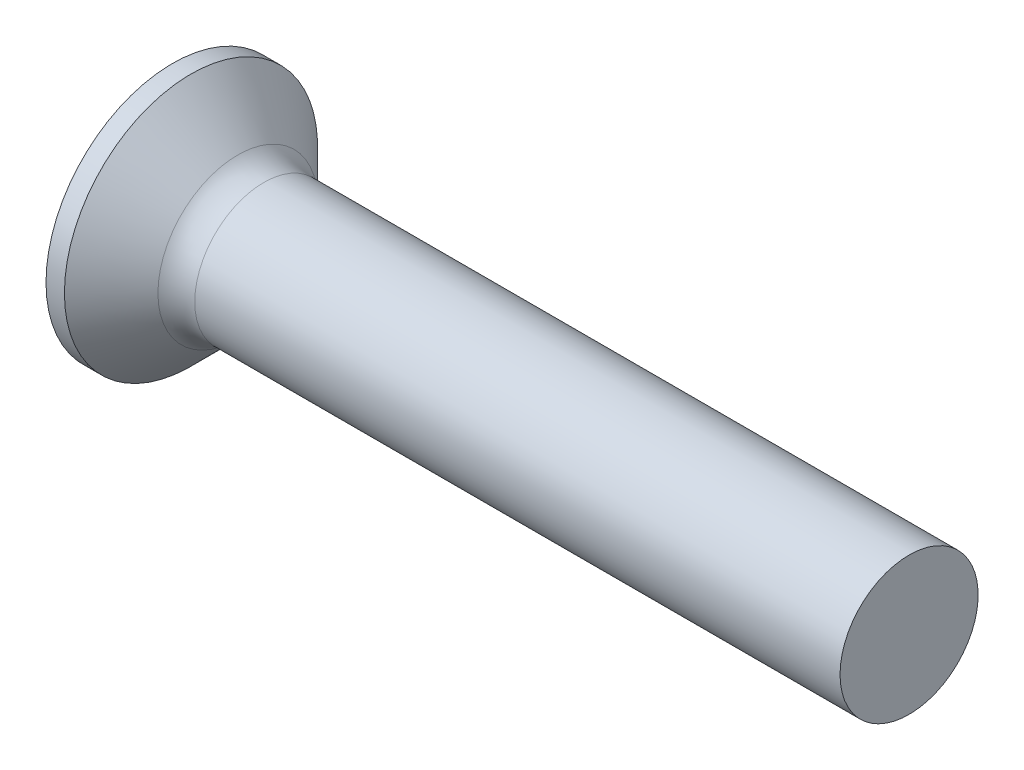
ISO-10303-21;
HEADER;
FILE_DESCRIPTION(('STEP AP214'),'2;1');
FILE_NAME('part.step','',(''),(''),'','','');
FILE_SCHEMA(('AUTOMOTIVE_DESIGN { 1 0 10303 214 1 1 1 1 }'));
ENDSEC;
DATA;
#1=APPLICATION_CONTEXT('core data for automotive mechanical design processes');
#2=APPLICATION_PROTOCOL_DEFINITION('international standard','automotive_design',2000,#1);
#3=PRODUCT_CONTEXT('',#1,'mechanical');
#4=PRODUCT('Part','Part','',(#3));
#5=PRODUCT_RELATED_PRODUCT_CATEGORY('part','',(#4));
#6=PRODUCT_DEFINITION_FORMATION('','',#4);
#7=PRODUCT_DEFINITION_CONTEXT('part definition',#1,'design');
#8=PRODUCT_DEFINITION('design','',#6,#7);
#9=PRODUCT_DEFINITION_SHAPE('','',#8);
#10=(LENGTH_UNIT() NAMED_UNIT(*) SI_UNIT(.MILLI.,.METRE.));
#11=(NAMED_UNIT(*) PLANE_ANGLE_UNIT() SI_UNIT($,.RADIAN.));
#12=(NAMED_UNIT(*) SI_UNIT($,.STERADIAN.) SOLID_ANGLE_UNIT());
#13=UNCERTAINTY_MEASURE_WITH_UNIT(LENGTH_MEASURE(1.E-05),#10,'distance_accuracy_value','');
#14=(GEOMETRIC_REPRESENTATION_CONTEXT(3) GLOBAL_UNCERTAINTY_ASSIGNED_CONTEXT((#13)) GLOBAL_UNIT_ASSIGNED_CONTEXT((#10,
#11,#12)) REPRESENTATION_CONTEXT('',''));
#15=CARTESIAN_POINT('',(0.,0.,0.));
#16=DIRECTION('',(0.,0.,1.));
#17=DIRECTION('',(1.,0.,0.));
#18=AXIS2_PLACEMENT_3D('',#15,#16,#17);
#19=CARTESIAN_POINT('',(2.01,-0.497851135403458,0.37));
#20=DIRECTION('',(0.,0.,-1.));
#21=DIRECTION('',(0.,1.,0.));
#22=AXIS2_PLACEMENT_3D('',#19,#20,#21);
#23=PLANE('',#22);
#24=DIRECTION('',(0.,-1.,0.));
#25=VECTOR('',#24,1.);
#26=CARTESIAN_POINT('',(0.,1.5,0.37));
#27=LINE('',#26,#25);
#28=CARTESIAN_POINT('',(0.,-0.590157547916263,0.37));
#29=VERTEX_POINT('',#28);
#30=CARTESIAN_POINT('',(0.,-1.5,0.37));
#31=VERTEX_POINT('',#30);
#32=EDGE_CURVE('E458',#29,#31,#27,.T.);
#33=ORIENTED_EDGE('',*,*,#32,.F.);
#34=CARTESIAN_POINT('',(-1.01053649691082,-0.672102030072118,0.37));
#35=CARTESIAN_POINT('',(-0.79970605871103,-0.655267098883947,0.37));
#36=CARTESIAN_POINT('',(-0.588886212503304,-0.638297110572311,0.37));
#37=CARTESIAN_POINT('',(-0.167272662529611,-0.603984130519828,0.37));
#38=CARTESIAN_POINT('',(0.0435210406290472,-0.586641131324258,0.37));
#39=CARTESIAN_POINT('',(0.465068838244709,-0.551479911667385,0.37));
#40=CARTESIAN_POINT('',(0.67582293271526,-0.533661691368909,0.37));
#41=CARTESIAN_POINT('',(1.09727362083221,-0.497387538872971,0.37));
#42=CARTESIAN_POINT('',(1.30797021521736,-0.478931615299089,0.37));
#43=CARTESIAN_POINT('',(1.67418894757201,-0.446067164121906,0.37));
#44=CARTESIAN_POINT('',(1.82972932585734,-0.431862501028414,0.37));
#45=CARTESIAN_POINT('',(2.14074770359484,-0.40279770973988,0.37));
#46=CARTESIAN_POINT('',(2.29622570356215,-0.38793758707517,0.37));
#47=CARTESIAN_POINT('',(2.60710169348415,-0.357305117937677,0.37));
#48=CARTESIAN_POINT('',(2.76249967840253,-0.34153271979064,0.37));
#49=CARTESIAN_POINT('',(2.99549070742189,-0.316847908281595,0.37));
#50=CARTESIAN_POINT('',(3.07313791118864,-0.308448465897182,0.37));
#51=CARTESIAN_POINT('',(3.22838341575769,-0.29120225104834,0.37));
#52=CARTESIAN_POINT('',(3.30598171599396,-0.282355473499083,0.37));
#53=CARTESIAN_POINT('',(3.38354828463398,-0.273232461289951,0.37));
#54=B_SPLINE_CURVE_WITH_KNOTS('',3,(#34,#35,#36,#37,#38,#39,#40,#41,#42,#43,#44,#45,#46,#47,#48,
#49,#50,#51,#52,#53),.UNSPECIFIED.,.F.,.F.,(4,2,2,2,2,2,2,2,2,4),(0.,0.634504777554397,
1.26902224766093,1.90353950036111,2.53804817592041,3.00661008438666,3.47516804019383,
3.94375256268972,4.17805198331268,4.41235406779909),.UNSPECIFIED.);
#55=CARTESIAN_POINT('',(2.01,-0.415013252800437,0.37));
#56=VERTEX_POINT('',#55);
#57=EDGE_CURVE('E214',#29,#56,#54,.T.);
#58=ORIENTED_EDGE('',*,*,#57,.T.);
#59=DIRECTION('',(0.,-1.,0.));
#60=VECTOR('',#59,1.);
#61=CARTESIAN_POINT('',(2.01,0.497851135403459,0.37));
#62=LINE('',#61,#60);
#63=CARTESIAN_POINT('',(2.01,-0.497851135403458,0.37));
#64=VERTEX_POINT('',#63);
#65=EDGE_CURVE('E367',#56,#64,#62,.T.);
#66=ORIENTED_EDGE('',*,*,#65,.T.);
#67=DIRECTION('',(0.894934391398442,0.446197753347436,0.));
#68=VECTOR('',#67,1.);
#69=CARTESIAN_POINT('',(0.,-1.5,0.37));
#70=LINE('',#69,#68);
#71=EDGE_CURVE('E466',#31,#64,#70,.T.);
#72=ORIENTED_EDGE('',*,*,#71,.F.);
#73=EDGE_LOOP('',(#33,#58,#66,#72));
#74=FACE_BOUND('',#73,.T.);
#75=ADVANCED_FACE('F35',(#74),#23,.T.);
#76=CARTESIAN_POINT('',(2.01,0.497851135403459,0.37));
#77=VERTEX_POINT('',#76);
#78=CARTESIAN_POINT('',(2.01,0.415013252800437,0.37));
#79=VERTEX_POINT('',#78);
#80=EDGE_CURVE('E363',#77,#79,#62,.T.);
#81=ORIENTED_EDGE('',*,*,#80,.T.);
#82=CARTESIAN_POINT('',(-1.01053649699026,0.672102030078459,0.37));
#83=CARTESIAN_POINT('',(-0.799706058781648,0.65526709888962,0.37));
#84=CARTESIAN_POINT('',(-0.588886212565099,0.638297110577309,0.37));
#85=CARTESIAN_POINT('',(-0.167272662573758,0.603984130523453,0.37));
#86=CARTESIAN_POINT('',(0.043521040593722,0.586641131327185,0.37));
#87=CARTESIAN_POINT('',(0.465068838236453,0.551479911668094,0.37));
#88=CARTESIAN_POINT('',(0.675822932725248,0.533661691368078,0.37));
#89=CARTESIAN_POINT('',(1.09727362087867,0.497387538868943,0.37));
#90=CARTESIAN_POINT('',(1.30797021528206,0.478931615293404,0.37));
#91=CARTESIAN_POINT('',(1.67418894765493,0.446067164114376,0.37));
#92=CARTESIAN_POINT('',(1.82972932594025,0.431862501020785,0.37));
#93=CARTESIAN_POINT('',(2.14074770367772,0.402797709732016,0.37));
#94=CARTESIAN_POINT('',(2.29622570364503,0.38793758706717,0.37));
#95=CARTESIAN_POINT('',(2.60710169356699,0.357305117929346,0.37));
#96=CARTESIAN_POINT('',(2.76249967848536,0.341532719782116,0.37));
#97=CARTESIAN_POINT('',(2.99549070750468,0.316847908272698,0.37));
#98=CARTESIAN_POINT('',(3.07313791127142,0.308448465888148,0.37));
#99=CARTESIAN_POINT('',(3.22838341584044,0.291202251038989,0.37));
#100=CARTESIAN_POINT('',(3.30598171607669,0.282355473489554,0.37));
#101=CARTESIAN_POINT('',(3.38354828471668,0.273232461280216,0.37));
#102=B_SPLINE_CURVE_WITH_KNOTS('',3,(#82,#83,#84,#85,#86,#87,#88,#89,#90,#91,#92,#93,#94,#95,
#96,#97,#98,#99,#100,#101),.UNSPECIFIED.,.F.,.F.,(4,2,2,2,2,2,2,2,2,4),(0.,0.634504777580945,
1.26902224771403,1.90353950046914,2.53804817608336,3.00661008454961,3.47516804035678,
3.94375256285268,4.17805198347564,4.41235406796206),.UNSPECIFIED.);
#103=CARTESIAN_POINT('',(0.,0.590157547916263,0.37));
#104=VERTEX_POINT('',#103);
#105=EDGE_CURVE('E207',#79,#104,#102,.F.);
#106=ORIENTED_EDGE('',*,*,#105,.T.);
#107=CARTESIAN_POINT('',(0.,1.5,0.37));
#108=VERTEX_POINT('',#107);
#109=EDGE_CURVE('E460',#108,#104,#27,.T.);
#110=ORIENTED_EDGE('',*,*,#109,.F.);
#111=DIRECTION('',(0.894934391398442,-0.446197753347436,0.));
#112=VECTOR('',#111,1.);
#113=CARTESIAN_POINT('',(0.,1.5,0.37));
#114=LINE('',#113,#112);
#115=EDGE_CURVE('E58',#108,#77,#114,.T.);
#116=ORIENTED_EDGE('',*,*,#115,.T.);
#117=EDGE_LOOP('',(#81,#106,#110,#116));
#118=FACE_BOUND('',#117,.T.);
#119=ADVANCED_FACE('F189',(#118),#23,.T.);
#120=CARTESIAN_POINT('',(2.01,0.497851135403458,-0.37));
#121=DIRECTION('',(0.,0.,1.));
#122=DIRECTION('',(1.,0.,0.));
#123=AXIS2_PLACEMENT_3D('',#120,#121,#122);
#124=PLANE('',#123);
#125=DIRECTION('',(0.,1.,0.));
#126=VECTOR('',#125,1.);
#127=CARTESIAN_POINT('',(2.01,-0.497851135403458,-0.37));
#128=LINE('',#127,#126);
#129=CARTESIAN_POINT('',(2.01,-0.497851135403458,-0.37));
#130=VERTEX_POINT('',#129);
#131=CARTESIAN_POINT('',(2.01,-0.415013252800437,-0.37));
#132=VERTEX_POINT('',#131);
#133=EDGE_CURVE('E376',#130,#132,#128,.T.);
#134=ORIENTED_EDGE('',*,*,#133,.T.);
#135=CARTESIAN_POINT('',(-1.01053649691082,-0.672102030072118,-0.37));
#136=CARTESIAN_POINT('',(-0.79970605871103,-0.655267098883947,-0.37));
#137=CARTESIAN_POINT('',(-0.588886212503305,-0.638297110572311,-0.37));
#138=CARTESIAN_POINT('',(-0.16727266252961,-0.603984130519828,-0.37));
#139=CARTESIAN_POINT('',(0.0435210406290472,-0.586641131324259,-0.37));
#140=CARTESIAN_POINT('',(0.465068838244709,-0.551479911667385,-0.37));
#141=CARTESIAN_POINT('',(0.67582293271526,-0.533661691368909,-0.37));
#142=CARTESIAN_POINT('',(1.09727362083221,-0.497387538872971,-0.37));
#143=CARTESIAN_POINT('',(1.30797021521736,-0.47893161529909,-0.37));
#144=CARTESIAN_POINT('',(1.67418894757201,-0.446067164121906,-0.37));
#145=CARTESIAN_POINT('',(1.82972932585734,-0.431862501028414,-0.37));
#146=CARTESIAN_POINT('',(2.14074770359484,-0.40279770973988,-0.37));
#147=CARTESIAN_POINT('',(2.29622570356215,-0.38793758707517,-0.37));
#148=CARTESIAN_POINT('',(2.60710169348415,-0.357305117937677,-0.37));
#149=CARTESIAN_POINT('',(2.76249967840254,-0.34153271979064,-0.37));
#150=CARTESIAN_POINT('',(2.99549070742189,-0.316847908281595,-0.37));
#151=CARTESIAN_POINT('',(3.07313791118864,-0.308448465897182,-0.37));
#152=CARTESIAN_POINT('',(3.22838341575769,-0.29120225104834,-0.37));
#153=CARTESIAN_POINT('',(3.30598171599396,-0.282355473499083,-0.37));
#154=CARTESIAN_POINT('',(3.38354828463398,-0.273232461289951,-0.37));
#155=B_SPLINE_CURVE_WITH_KNOTS('',3,(#135,#136,#137,#138,#139,#140,#141,#142,#143,#144,#145,
#146,#147,#148,#149,#150,#151,#152,#153,#154),.UNSPECIFIED.,.F.,.F.,(4,2,2,2,2,2,2,2,2,4),(0.,
0.634504777554397,1.26902224766093,1.90353950036111,2.53804817592041,3.00661008438666,
3.47516804019383,3.94375256268973,4.17805198331268,4.41235406779909),.UNSPECIFIED.);
#156=CARTESIAN_POINT('',(0.,-0.590157547916263,-0.37));
#157=VERTEX_POINT('',#156);
#158=EDGE_CURVE('E270',#132,#157,#155,.F.);
#159=ORIENTED_EDGE('',*,*,#158,.T.);
#160=DIRECTION('',(0.,1.,0.));
#161=VECTOR('',#160,1.);
#162=CARTESIAN_POINT('',(0.,-1.5,-0.37));
#163=LINE('',#162,#161);
#164=CARTESIAN_POINT('',(0.,-1.5,-0.37));
#165=VERTEX_POINT('',#164);
#166=EDGE_CURVE('E459',#165,#157,#163,.T.);
#167=ORIENTED_EDGE('',*,*,#166,.F.);
#168=DIRECTION('',(0.894934391398442,0.446197753347436,0.));
#169=VECTOR('',#168,1.);
#170=CARTESIAN_POINT('',(0.,-1.5,-0.37));
#171=LINE('',#170,#169);
#172=EDGE_CURVE('E469',#165,#130,#171,.T.);
#173=ORIENTED_EDGE('',*,*,#172,.T.);
#174=EDGE_LOOP('',(#134,#159,#167,#173));
#175=FACE_BOUND('',#174,.T.);
#176=ADVANCED_FACE('F195',(#175),#124,.T.);
#177=CARTESIAN_POINT('',(0.,0.590157547916263,-0.37));
#178=VERTEX_POINT('',#177);
#179=CARTESIAN_POINT('',(0.,1.5,-0.37));
#180=VERTEX_POINT('',#179);
#181=EDGE_CURVE('E465',#178,#180,#163,.T.);
#182=ORIENTED_EDGE('',*,*,#181,.F.);
#183=CARTESIAN_POINT('',(-1.01053649691082,0.672102030072118,-0.37));
#184=CARTESIAN_POINT('',(-0.79970605871103,0.655267098883947,-0.37));
#185=CARTESIAN_POINT('',(-0.588886212503304,0.638297110572311,-0.37));
#186=CARTESIAN_POINT('',(-0.16727266252961,0.603984130519828,-0.37));
#187=CARTESIAN_POINT('',(0.0435210406290473,0.586641131324259,-0.37));
#188=CARTESIAN_POINT('',(0.465068838244709,0.551479911667385,-0.37));
#189=CARTESIAN_POINT('',(0.67582293271526,0.533661691368909,-0.37));
#190=CARTESIAN_POINT('',(1.09727362083221,0.497387538872971,-0.37));
#191=CARTESIAN_POINT('',(1.30797021521736,0.478931615299089,-0.37));
#192=CARTESIAN_POINT('',(1.67418894757201,0.446067164121906,-0.37));
#193=CARTESIAN_POINT('',(1.82972932585734,0.431862501028415,-0.37));
#194=CARTESIAN_POINT('',(2.14074770359484,0.40279770973988,-0.37));
#195=CARTESIAN_POINT('',(2.29622570356215,0.38793758707517,-0.37));
#196=CARTESIAN_POINT('',(2.60710169348415,0.357305117937677,-0.37));
#197=CARTESIAN_POINT('',(2.76249967840253,0.34153271979064,-0.37));
#198=CARTESIAN_POINT('',(2.99549070742189,0.316847908281595,-0.37));
#199=CARTESIAN_POINT('',(3.07313791118864,0.308448465897183,-0.37));
#200=CARTESIAN_POINT('',(3.22838341575769,0.29120225104834,-0.37));
#201=CARTESIAN_POINT('',(3.30598171599396,0.282355473499083,-0.37));
#202=CARTESIAN_POINT('',(3.38354828463398,0.273232461289951,-0.37));
#203=B_SPLINE_CURVE_WITH_KNOTS('',3,(#183,#184,#185,#186,#187,#188,#189,#190,#191,#192,#193,
#194,#195,#196,#197,#198,#199,#200,#201,#202),.UNSPECIFIED.,.F.,.F.,(4,2,2,2,2,2,2,2,2,4),(0.,
0.634504777554397,1.26902224766093,1.90353950036111,2.53804817592041,3.00661008438666,
3.47516804019383,3.94375256268972,4.17805198331267,4.41235406779909),.UNSPECIFIED.);
#204=CARTESIAN_POINT('',(2.01,0.415013252800437,-0.37));
#205=VERTEX_POINT('',#204);
#206=EDGE_CURVE('E264',#178,#205,#203,.T.);
#207=ORIENTED_EDGE('',*,*,#206,.T.);
#208=CARTESIAN_POINT('',(2.01,0.497851135403459,-0.37));
#209=VERTEX_POINT('',#208);
#210=EDGE_CURVE('E378',#205,#209,#128,.T.);
#211=ORIENTED_EDGE('',*,*,#210,.T.);
#212=DIRECTION('',(0.894934391398442,-0.446197753347436,0.));
#213=VECTOR('',#212,1.);
#214=CARTESIAN_POINT('',(0.,1.5,-0.37));
#215=LINE('',#214,#213);
#216=EDGE_CURVE('E375',#180,#209,#215,.T.);
#217=ORIENTED_EDGE('',*,*,#216,.F.);
#218=EDGE_LOOP('',(#182,#207,#211,#217));
#219=FACE_BOUND('',#218,.T.);
#220=ADVANCED_FACE('F476',(#219),#124,.T.);
#221=CARTESIAN_POINT('',(2.01,0.497851135403459,-0.37));
#222=DIRECTION('',(1.,0.,0.));
#223=DIRECTION('',(0.,0.,-1.));
#224=AXIS2_PLACEMENT_3D('',#221,#222,#223);
#225=PLANE('',#224);
#226=CARTESIAN_POINT('',(2.01,0.,0.));
#227=DIRECTION('',(-1.,0.,0.));
#228=DIRECTION('',(0.,0.,1.));
#229=AXIS2_PLACEMENT_3D('',#226,#227,#228);
#230=CIRCLE('',#229,0.555999999999999);
#231=CARTESIAN_POINT('',(2.01,-0.24754847399547,-0.497851135403459));
#232=VERTEX_POINT('',#231);
#233=CARTESIAN_POINT('',(2.01,-0.369999999999999,-0.415013252800438));
#234=VERTEX_POINT('',#233);
#235=EDGE_CURVE('E342',#232,#234,#230,.T.);
#236=ORIENTED_EDGE('',*,*,#235,.F.);
#237=DIRECTION('',(0.,1.,0.));
#238=VECTOR('',#237,1.);
#239=CARTESIAN_POINT('',(2.01,-0.369999999999998,-0.49785113540346));
#240=LINE('',#239,#238);
#241=CARTESIAN_POINT('',(2.01,-0.369999999999998,-0.49785113540346));
#242=VERTEX_POINT('',#241);
#243=EDGE_CURVE('E443',#242,#232,#240,.T.);
#244=ORIENTED_EDGE('',*,*,#243,.F.);
#245=DIRECTION('',(0.,0.,-1.));
#246=VECTOR('',#245,1.);
#247=CARTESIAN_POINT('',(2.01,-0.370000000000002,0.497851135403457));
#248=LINE('',#247,#246);
#249=EDGE_CURVE('E447',#234,#242,#248,.T.);
#250=ORIENTED_EDGE('',*,*,#249,.F.);
#251=EDGE_LOOP('',(#236,#244,#250));
#252=FACE_BOUND('',#251,.T.);
#253=ADVANCED_FACE('F489',(#252),#225,.F.);
#254=CARTESIAN_POINT('',(2.01,-0.497851135403458,-0.247548473995472));
#255=VERTEX_POINT('',#254);
#256=EDGE_CURVE('E337',#132,#255,#230,.T.);
#257=ORIENTED_EDGE('',*,*,#256,.F.);
#258=ORIENTED_EDGE('',*,*,#133,.F.);
#259=DIRECTION('',(0.,0.,-1.));
#260=VECTOR('',#259,1.);
#261=CARTESIAN_POINT('',(2.01,-0.497851135403458,0.37));
#262=LINE('',#261,#260);
#263=EDGE_CURVE('E366',#255,#130,#262,.T.);
#264=ORIENTED_EDGE('',*,*,#263,.F.);
#265=EDGE_LOOP('',(#257,#258,#264));
#266=FACE_BOUND('',#265,.T.);
#267=ADVANCED_FACE('F495',(#266),#225,.F.);
#268=CARTESIAN_POINT('',(2.01,-0.497851135403458,0.247548473995472));
#269=VERTEX_POINT('',#268);
#270=EDGE_CURVE('E332',#269,#56,#230,.T.);
#271=ORIENTED_EDGE('',*,*,#270,.F.);
#272=EDGE_CURVE('E369',#64,#269,#262,.T.);
#273=ORIENTED_EDGE('',*,*,#272,.F.);
#274=ORIENTED_EDGE('',*,*,#65,.F.);
#275=EDGE_LOOP('',(#271,#273,#274));
#276=FACE_BOUND('',#275,.T.);
#277=ADVANCED_FACE('F501',(#276),#225,.F.);
#278=CARTESIAN_POINT('',(2.01,-0.370000000000001,0.415013252800436));
#279=VERTEX_POINT('',#278);
#280=CARTESIAN_POINT('',(2.01,-0.247548473995473,0.497851135403458));
#281=VERTEX_POINT('',#280);
#282=EDGE_CURVE('E50',#279,#281,#230,.T.);
#283=ORIENTED_EDGE('',*,*,#282,.F.);
#284=CARTESIAN_POINT('',(2.01,-0.370000000000002,0.497851135403457));
#285=VERTEX_POINT('',#284);
#286=EDGE_CURVE('E449',#285,#279,#248,.T.);
#287=ORIENTED_EDGE('',*,*,#286,.F.);
#288=DIRECTION('',(0.,-1.,0.));
#289=VECTOR('',#288,1.);
#290=CARTESIAN_POINT('',(2.01,0.369999999999998,0.49785113540346));
#291=LINE('',#290,#289);
#292=EDGE_CURVE('E448',#281,#285,#291,.T.);
#293=ORIENTED_EDGE('',*,*,#292,.F.);
#294=EDGE_LOOP('',(#283,#287,#293));
#295=FACE_BOUND('',#294,.T.);
#296=ADVANCED_FACE('F528',(#295),#225,.F.);
#297=CARTESIAN_POINT('',(2.01,0.24754847399547,0.497851135403459));
#298=VERTEX_POINT('',#297);
#299=CARTESIAN_POINT('',(2.01,0.369999999999999,0.415013252800438));
#300=VERTEX_POINT('',#299);
#301=EDGE_CURVE('E323',#298,#300,#230,.T.);
#302=ORIENTED_EDGE('',*,*,#301,.F.);
#303=CARTESIAN_POINT('',(2.01,0.369999999999998,0.49785113540346));
#304=VERTEX_POINT('',#303);
#305=EDGE_CURVE('E444',#304,#298,#291,.T.);
#306=ORIENTED_EDGE('',*,*,#305,.F.);
#307=DIRECTION('',(0.,0.,1.));
#308=VECTOR('',#307,1.);
#309=CARTESIAN_POINT('',(2.01,0.370000000000002,-0.497851135403457));
#310=LINE('',#309,#308);
#311=EDGE_CURVE('E221',#300,#304,#310,.T.);
#312=ORIENTED_EDGE('',*,*,#311,.F.);
#313=EDGE_LOOP('',(#302,#306,#312));
#314=FACE_BOUND('',#313,.T.);
#315=ADVANCED_FACE('F485',(#314),#225,.F.);
#316=CARTESIAN_POINT('',(2.01,0.497851135403459,0.247548473995472));
#317=VERTEX_POINT('',#316);
#318=EDGE_CURVE('E330',#79,#317,#230,.T.);
#319=ORIENTED_EDGE('',*,*,#318,.F.);
#320=ORIENTED_EDGE('',*,*,#80,.F.);
#321=DIRECTION('',(0.,0.,1.));
#322=VECTOR('',#321,1.);
#323=CARTESIAN_POINT('',(2.01,0.497851135403459,-0.37));
#324=LINE('',#323,#322);
#325=EDGE_CURVE('E364',#317,#77,#324,.T.);
#326=ORIENTED_EDGE('',*,*,#325,.F.);
#327=EDGE_LOOP('',(#319,#320,#326));
#328=FACE_BOUND('',#327,.T.);
#329=ADVANCED_FACE('F362',(#328),#225,.F.);
#330=CARTESIAN_POINT('',(2.01,0.497851135403459,-0.247548473995472));
#331=VERTEX_POINT('',#330);
#332=EDGE_CURVE('E352',#331,#205,#230,.T.);
#333=ORIENTED_EDGE('',*,*,#332,.F.);
#334=EDGE_CURVE('E371',#209,#331,#324,.T.);
#335=ORIENTED_EDGE('',*,*,#334,.F.);
#336=ORIENTED_EDGE('',*,*,#210,.F.);
#337=EDGE_LOOP('',(#333,#335,#336));
#338=FACE_BOUND('',#337,.T.);
#339=ADVANCED_FACE('F478',(#338),#225,.F.);
#340=CARTESIAN_POINT('',(2.01,-0.497851135403458,-0.37));
#341=DIRECTION('',(-0.446197753347436,0.894934391398443,0.));
#342=DIRECTION('',(-0.894934391398442,-0.446197753347436,0.));
#343=AXIS2_PLACEMENT_3D('',#340,#341,#342);
#344=PLANE('',#343);
#345=ORIENTED_EDGE('',*,*,#272,.T.);
#346=CARTESIAN_POINT('',(2.86902919914418,-0.0695550475538963,0.));
#347=DIRECTION('',(-0.446197753347436,0.894934391398443,0.));
#348=DIRECTION('',(-0.894934391398443,-0.446197753347436,0.));
#349=AXIS2_PLACEMENT_3D('',#346,#347,#348);
#350=ELLIPSE('',#349,1.11145971268776,0.491029001453358);
#351=EDGE_CURVE('E282',#269,#255,#350,.F.);
#352=ORIENTED_EDGE('',*,*,#351,.T.);
#353=ORIENTED_EDGE('',*,*,#263,.T.);
#354=ORIENTED_EDGE('',*,*,#172,.F.);
#355=DIRECTION('',(0.,0.,-1.));
#356=VECTOR('',#355,1.);
#357=CARTESIAN_POINT('',(0.,-1.5,0.37));
#358=LINE('',#357,#356);
#359=EDGE_CURVE('E383',#31,#165,#358,.T.);
#360=ORIENTED_EDGE('',*,*,#359,.F.);
#361=ORIENTED_EDGE('',*,*,#71,.T.);
#362=EDGE_LOOP('',(#345,#352,#353,#354,#360,#361));
#363=FACE_BOUND('',#362,.T.);
#364=ADVANCED_FACE('F201',(#363),#344,.T.);
#365=CARTESIAN_POINT('',(2.01,0.497851135403459,0.37));
#366=DIRECTION('',(-0.446197753347436,-0.894934391398443,0.));
#367=DIRECTION('',(0.894934391398442,-0.446197753347436,0.));
#368=AXIS2_PLACEMENT_3D('',#365,#366,#367);
#369=PLANE('',#368);
#370=ORIENTED_EDGE('',*,*,#334,.T.);
#371=CARTESIAN_POINT('',(2.86902919914418,0.0695550475538964,0.));
#372=DIRECTION('',(-0.446197753347436,-0.894934391398443,0.));
#373=DIRECTION('',(-0.894934391398443,0.446197753347436,0.));
#374=AXIS2_PLACEMENT_3D('',#371,#372,#373);
#375=ELLIPSE('',#374,1.11145971268776,0.491029001453358);
#376=EDGE_CURVE('E287',#331,#317,#375,.F.);
#377=ORIENTED_EDGE('',*,*,#376,.T.);
#378=ORIENTED_EDGE('',*,*,#325,.T.);
#379=ORIENTED_EDGE('',*,*,#115,.F.);
#380=DIRECTION('',(0.,0.,1.));
#381=VECTOR('',#380,1.);
#382=CARTESIAN_POINT('',(0.,1.5,-0.37));
#383=LINE('',#382,#381);
#384=EDGE_CURVE('E455',#180,#108,#383,.T.);
#385=ORIENTED_EDGE('',*,*,#384,.F.);
#386=ORIENTED_EDGE('',*,*,#216,.T.);
#387=EDGE_LOOP('',(#370,#377,#378,#379,#385,#386));
#388=FACE_BOUND('',#387,.T.);
#389=ADVANCED_FACE('F474',(#388),#369,.T.);
#390=CARTESIAN_POINT('',(2.01,0.369999999999998,0.497851135403459));
#391=DIRECTION('',(0.,-1.,0.));
#392=DIRECTION('',(1.,0.,0.));
#393=AXIS2_PLACEMENT_3D('',#390,#391,#392);
#394=PLANE('',#393);
#395=CARTESIAN_POINT('',(2.01,0.370000000000002,-0.497851135403457));
#396=VERTEX_POINT('',#395);
#397=CARTESIAN_POINT('',(2.01,0.370000000000001,-0.415013252800436));
#398=VERTEX_POINT('',#397);
#399=EDGE_CURVE('E453',#396,#398,#310,.T.);
#400=ORIENTED_EDGE('',*,*,#399,.T.);
#401=CARTESIAN_POINT('',(-1.01053649699026,0.370000000000002,-0.672102030078458));
#402=CARTESIAN_POINT('',(-0.799706058781648,0.370000000000002,-0.655267098889619));
#403=CARTESIAN_POINT('',(-0.588886212565099,0.370000000000002,-0.638297110577308));
#404=CARTESIAN_POINT('',(-0.167272662573758,0.370000000000002,-0.603984130523452));
#405=CARTESIAN_POINT('',(0.0435210405937218,0.370000000000002,-0.586641131327184));
#406=CARTESIAN_POINT('',(0.465068838236452,0.370000000000002,-0.551479911668093));
#407=CARTESIAN_POINT('',(0.675822932725247,0.370000000000002,-0.533661691368077));
#408=CARTESIAN_POINT('',(1.09727362087867,0.370000000000002,-0.497387538868942));
#409=CARTESIAN_POINT('',(1.30797021528206,0.370000000000002,-0.478931615293403));
#410=CARTESIAN_POINT('',(1.67418894765493,0.370000000000001,-0.446067164114375));
#411=CARTESIAN_POINT('',(1.82972932594025,0.370000000000001,-0.431862501020784));
#412=CARTESIAN_POINT('',(2.14074770367772,0.370000000000001,-0.402797709732014));
#413=CARTESIAN_POINT('',(2.29622570364503,0.370000000000001,-0.387937587067169));
#414=CARTESIAN_POINT('',(2.60710169356699,0.370000000000001,-0.357305117929345));
#415=CARTESIAN_POINT('',(2.76249967848536,0.370000000000001,-0.341532719782114));
#416=CARTESIAN_POINT('',(2.99549070750468,0.370000000000001,-0.316847908272697));
#417=CARTESIAN_POINT('',(3.07313791127142,0.370000000000001,-0.308448465888147));
#418=CARTESIAN_POINT('',(3.22838341584044,0.370000000000001,-0.291202251038988));
#419=CARTESIAN_POINT('',(3.30598171607669,0.370000000000001,-0.282355473489552));
#420=CARTESIAN_POINT('',(3.38354828471668,0.370000000000001,-0.273232461280215));
#421=B_SPLINE_CURVE_WITH_KNOTS('',3,(#401,#402,#403,#404,#405,#406,#407,#408,#409,#410,#411,
#412,#413,#414,#415,#416,#417,#418,#419,#420),.UNSPECIFIED.,.F.,.F.,(4,2,2,2,2,2,2,2,2,4),(0.,
0.634504777580945,1.26902224771403,1.90353950046914,2.53804817608336,3.00661008454961,
3.47516804035678,3.94375256285268,4.17805198347564,4.41235406796206),.UNSPECIFIED.);
#422=CARTESIAN_POINT('',(0.,0.370000000000002,-0.590157547916262));
#423=VERTEX_POINT('',#422);
#424=EDGE_CURVE('E256',#398,#423,#421,.F.);
#425=ORIENTED_EDGE('',*,*,#424,.T.);
#426=DIRECTION('',(0.,0.,1.));
#427=VECTOR('',#426,1.);
#428=CARTESIAN_POINT('',(0.,0.370000000000005,-1.5));
#429=LINE('',#428,#427);
#430=CARTESIAN_POINT('',(0.,0.370000000000005,-1.5));
#431=VERTEX_POINT('',#430);
#432=EDGE_CURVE('E429',#431,#423,#429,.T.);
#433=ORIENTED_EDGE('',*,*,#432,.F.);
#434=DIRECTION('',(0.894934391398442,0.,0.446197753347436));
#435=VECTOR('',#434,1.);
#436=CARTESIAN_POINT('',(0.,0.370000000000005,-1.5));
#437=LINE('',#436,#435);
#438=EDGE_CURVE('E435',#431,#396,#437,.T.);
#439=ORIENTED_EDGE('',*,*,#438,.T.);
#440=EDGE_LOOP('',(#400,#425,#433,#439));
#441=FACE_BOUND('',#440,.T.);
#442=ADVANCED_FACE('F608',(#441),#394,.T.);
#443=CARTESIAN_POINT('',(2.01,-0.369999999999998,-0.497851135403459));
#444=DIRECTION('',(0.,1.,0.));
#445=DIRECTION('',(0.,0.,1.));
#446=AXIS2_PLACEMENT_3D('',#443,#444,#445);
#447=PLANE('',#446);
#448=DIRECTION('',(0.,0.,-1.));
#449=VECTOR('',#448,1.);
#450=CARTESIAN_POINT('',(0.,-0.370000000000005,1.5));
#451=LINE('',#450,#449);
#452=CARTESIAN_POINT('',(0.,-0.369999999999998,-0.590157547916264));
#453=VERTEX_POINT('',#452);
#454=CARTESIAN_POINT('',(0.,-0.369999999999995,-1.5));
#455=VERTEX_POINT('',#454);
#456=EDGE_CURVE('E425',#453,#455,#451,.T.);
#457=ORIENTED_EDGE('',*,*,#456,.F.);
#458=CARTESIAN_POINT('',(-1.01053649699026,-0.369999999999998,-0.67210203007846));
#459=CARTESIAN_POINT('',(-0.799706058781648,-0.369999999999998,-0.655267098889622));
#460=CARTESIAN_POINT('',(-0.588886212565099,-0.369999999999998,-0.638297110577311));
#461=CARTESIAN_POINT('',(-0.167272662573759,-0.369999999999998,-0.603984130523454));
#462=CARTESIAN_POINT('',(0.0435210405937218,-0.369999999999998,-0.586641131327186));
#463=CARTESIAN_POINT('',(0.465068838236453,-0.369999999999998,-0.551479911668095));
#464=CARTESIAN_POINT('',(0.675822932725248,-0.369999999999998,-0.53366169136808));
#465=CARTESIAN_POINT('',(1.09727362087867,-0.369999999999998,-0.497387538868944));
#466=CARTESIAN_POINT('',(1.30797021528206,-0.369999999999998,-0.478931615293405));
#467=CARTESIAN_POINT('',(1.67418894765493,-0.369999999999999,-0.446067164114377));
#468=CARTESIAN_POINT('',(1.82972932594025,-0.369999999999999,-0.431862501020786));
#469=CARTESIAN_POINT('',(2.14074770367772,-0.369999999999999,-0.402797709732017));
#470=CARTESIAN_POINT('',(2.29622570364503,-0.369999999999999,-0.387937587067171));
#471=CARTESIAN_POINT('',(2.60710169356699,-0.369999999999999,-0.357305117929348));
#472=CARTESIAN_POINT('',(2.76249967848536,-0.369999999999999,-0.341532719782117));
#473=CARTESIAN_POINT('',(2.99549070750468,-0.369999999999999,-0.316847908272699));
#474=CARTESIAN_POINT('',(3.07313791127142,-0.369999999999999,-0.30844846588815));
#475=CARTESIAN_POINT('',(3.22838341584044,-0.369999999999999,-0.291202251038991));
#476=CARTESIAN_POINT('',(3.30598171607669,-0.369999999999999,-0.282355473489555));
#477=CARTESIAN_POINT('',(3.38354828471668,-0.369999999999999,-0.273232461280217));
#478=B_SPLINE_CURVE_WITH_KNOTS('',3,(#458,#459,#460,#461,#462,#463,#464,#465,#466,#467,#468,
#469,#470,#471,#472,#473,#474,#475,#476,#477),.UNSPECIFIED.,.F.,.F.,(4,2,2,2,2,2,2,2,2,4),(0.,
0.634504777580943,1.26902224771403,1.90353950046914,2.53804817608336,3.00661008454961,
3.47516804035678,3.94375256285268,4.17805198347564,4.41235406796206),.UNSPECIFIED.);
#479=EDGE_CURVE('E249',#453,#234,#478,.T.);
#480=ORIENTED_EDGE('',*,*,#479,.T.);
#481=ORIENTED_EDGE('',*,*,#249,.T.);
#482=DIRECTION('',(0.894934391398442,0.,0.446197753347436));
#483=VECTOR('',#482,1.);
#484=CARTESIAN_POINT('',(0.,-0.369999999999995,-1.5));
#485=LINE('',#484,#483);
#486=EDGE_CURVE('E432',#455,#242,#485,.T.);
#487=ORIENTED_EDGE('',*,*,#486,.F.);
#488=EDGE_LOOP('',(#457,#480,#481,#487));
#489=FACE_BOUND('',#488,.T.);
#490=ADVANCED_FACE('F506',(#489),#447,.T.);
#491=CARTESIAN_POINT('',(2.01,0.370000000000002,-0.497851135403457));
#492=DIRECTION('',(-0.446197753347436,0.,0.894934391398443));
#493=DIRECTION('',(-0.894934391398442,0.,-0.446197753347436));
#494=AXIS2_PLACEMENT_3D('',#491,#492,#493);
#495=PLANE('',#494);
#496=ORIENTED_EDGE('',*,*,#243,.T.);
#497=CARTESIAN_POINT('',(2.86902919914418,0.,-0.0695550475538964));
#498=DIRECTION('',(-0.446197753347436,0.,0.894934391398443));
#499=DIRECTION('',(-0.894934391398443,0.,-0.446197753347436));
#500=AXIS2_PLACEMENT_3D('',#497,#498,#499);
#501=ELLIPSE('',#500,1.11145971268776,0.491029001453358);
#502=CARTESIAN_POINT('',(2.01,0.247548473995474,-0.497851135403457));
#503=VERTEX_POINT('',#502);
#504=EDGE_CURVE('E300',#232,#503,#501,.F.);
#505=ORIENTED_EDGE('',*,*,#504,.T.);
#506=EDGE_CURVE('E451',#503,#396,#240,.T.);
#507=ORIENTED_EDGE('',*,*,#506,.T.);
#508=ORIENTED_EDGE('',*,*,#438,.F.);
#509=DIRECTION('',(0.,1.,0.));
#510=VECTOR('',#509,1.);
#511=CARTESIAN_POINT('',(0.,-0.369999999999995,-1.5));
#512=LINE('',#511,#510);
#513=EDGE_CURVE('E424',#455,#431,#512,.T.);
#514=ORIENTED_EDGE('',*,*,#513,.F.);
#515=ORIENTED_EDGE('',*,*,#486,.T.);
#516=EDGE_LOOP('',(#496,#505,#507,#508,#514,#515));
#517=FACE_BOUND('',#516,.T.);
#518=ADVANCED_FACE('F226',(#517),#495,.T.);
#519=ORIENTED_EDGE('',*,*,#286,.T.);
#520=CARTESIAN_POINT('',(-1.01053649699026,-0.370000000000002,0.672102030078458));
#521=CARTESIAN_POINT('',(-0.799706058781648,-0.370000000000002,0.655267098889619));
#522=CARTESIAN_POINT('',(-0.588886212565099,-0.370000000000002,0.638297110577308));
#523=CARTESIAN_POINT('',(-0.167272662573758,-0.370000000000002,0.603984130523451));
#524=CARTESIAN_POINT('',(0.0435210405937218,-0.370000000000002,0.586641131327183));
#525=CARTESIAN_POINT('',(0.465068838236452,-0.370000000000002,0.551479911668093));
#526=CARTESIAN_POINT('',(0.675822932725247,-0.370000000000002,0.533661691368077));
#527=CARTESIAN_POINT('',(1.09727362087867,-0.370000000000002,0.497387538868942));
#528=CARTESIAN_POINT('',(1.30797021528206,-0.370000000000002,0.478931615293403));
#529=CARTESIAN_POINT('',(1.67418894765493,-0.370000000000002,0.446067164114375));
#530=CARTESIAN_POINT('',(1.82972932594025,-0.370000000000001,0.431862501020784));
#531=CARTESIAN_POINT('',(2.14074770367772,-0.370000000000001,0.402797709732014));
#532=CARTESIAN_POINT('',(2.29622570364503,-0.370000000000001,0.387937587067169));
#533=CARTESIAN_POINT('',(2.60710169356699,-0.370000000000001,0.357305117929345));
#534=CARTESIAN_POINT('',(2.76249967848536,-0.370000000000001,0.341532719782114));
#535=CARTESIAN_POINT('',(2.99549070750468,-0.370000000000001,0.316847908272697));
#536=CARTESIAN_POINT('',(3.07313791127142,-0.370000000000001,0.308448465888147));
#537=CARTESIAN_POINT('',(3.22838341584044,-0.370000000000001,0.291202251038988));
#538=CARTESIAN_POINT('',(3.30598171607669,-0.370000000000001,0.282355473489552));
#539=CARTESIAN_POINT('',(3.38354828471668,-0.370000000000001,0.273232461280214));
#540=B_SPLINE_CURVE_WITH_KNOTS('',3,(#520,#521,#522,#523,#524,#525,#526,#527,#528,#529,#530,
#531,#532,#533,#534,#535,#536,#537,#538,#539),.UNSPECIFIED.,.F.,.F.,(4,2,2,2,2,2,2,2,2,4),(0.,
0.634504777580945,1.26902224771403,1.90353950046914,2.53804817608336,3.00661008454961,
3.47516804035678,3.94375256285268,4.17805198347564,4.41235406796206),.UNSPECIFIED.);
#541=CARTESIAN_POINT('',(0.,-0.370000000000002,0.590157547916262));
#542=VERTEX_POINT('',#541);
#543=EDGE_CURVE('E241',#279,#542,#540,.F.);
#544=ORIENTED_EDGE('',*,*,#543,.T.);
#545=CARTESIAN_POINT('',(0.,-0.370000000000005,1.5));
#546=VERTEX_POINT('',#545);
#547=EDGE_CURVE('E420',#546,#542,#451,.T.);
#548=ORIENTED_EDGE('',*,*,#547,.F.);
#549=DIRECTION('',(0.894934391398442,0.,-0.446197753347436));
#550=VECTOR('',#549,1.);
#551=CARTESIAN_POINT('',(0.,-0.370000000000005,1.5));
#552=LINE('',#551,#550);
#553=EDGE_CURVE('E438',#546,#285,#552,.T.);
#554=ORIENTED_EDGE('',*,*,#553,.T.);
#555=EDGE_LOOP('',(#519,#544,#548,#554));
#556=FACE_BOUND('',#555,.T.);
#557=ADVANCED_FACE('F526',(#556),#447,.T.);
#558=CARTESIAN_POINT('',(0.,0.369999999999998,0.590157547916264));
#559=VERTEX_POINT('',#558);
#560=CARTESIAN_POINT('',(0.,0.369999999999995,1.5));
#561=VERTEX_POINT('',#560);
#562=EDGE_CURVE('E431',#559,#561,#429,.T.);
#563=ORIENTED_EDGE('',*,*,#562,.F.);
#564=CARTESIAN_POINT('',(-1.01053649699026,0.369999999999997,0.67210203007846));
#565=CARTESIAN_POINT('',(-0.799706058781648,0.369999999999998,0.655267098889622));
#566=CARTESIAN_POINT('',(-0.588886212565098,0.369999999999998,0.638297110577311));
#567=CARTESIAN_POINT('',(-0.167272662573758,0.369999999999998,0.603984130523454));
#568=CARTESIAN_POINT('',(0.0435210405937221,0.369999999999998,0.586641131327186));
#569=CARTESIAN_POINT('',(0.465068838236453,0.369999999999998,0.551479911668096));
#570=CARTESIAN_POINT('',(0.675822932725248,0.369999999999998,0.53366169136808));
#571=CARTESIAN_POINT('',(1.09727362087867,0.369999999999998,0.497387538868944));
#572=CARTESIAN_POINT('',(1.30797021528206,0.369999999999998,0.478931615293405));
#573=CARTESIAN_POINT('',(1.67418894765493,0.369999999999998,0.446067164114377));
#574=CARTESIAN_POINT('',(1.82972932594025,0.369999999999998,0.431862501020787));
#575=CARTESIAN_POINT('',(2.14074770367772,0.369999999999999,0.402797709732017));
#576=CARTESIAN_POINT('',(2.29622570364503,0.369999999999999,0.387937587067172));
#577=CARTESIAN_POINT('',(2.60710169356699,0.369999999999999,0.357305117929348));
#578=CARTESIAN_POINT('',(2.76249967848536,0.369999999999999,0.341532719782117));
#579=CARTESIAN_POINT('',(2.99549070750468,0.369999999999999,0.3168479082727));
#580=CARTESIAN_POINT('',(3.07313791127142,0.369999999999999,0.30844846588815));
#581=CARTESIAN_POINT('',(3.22838341584044,0.369999999999999,0.291202251038991));
#582=CARTESIAN_POINT('',(3.30598171607669,0.369999999999999,0.282355473489555));
#583=CARTESIAN_POINT('',(3.38354828471668,0.369999999999999,0.273232461280217));
#584=B_SPLINE_CURVE_WITH_KNOTS('',3,(#564,#565,#566,#567,#568,#569,#570,#571,#572,#573,#574,
#575,#576,#577,#578,#579,#580,#581,#582,#583),.UNSPECIFIED.,.F.,.F.,(4,2,2,2,2,2,2,2,2,4),(0.,
0.634504777580945,1.26902224771403,1.90353950046914,2.53804817608336,3.00661008454961,
3.47516804035678,3.94375256285268,4.17805198347564,4.41235406796206),.UNSPECIFIED.);
#585=EDGE_CURVE('E231',#559,#300,#584,.T.);
#586=ORIENTED_EDGE('',*,*,#585,.T.);
#587=ORIENTED_EDGE('',*,*,#311,.T.);
#588=DIRECTION('',(0.894934391398442,0.,-0.446197753347436));
#589=VECTOR('',#588,1.);
#590=CARTESIAN_POINT('',(0.,0.369999999999995,1.5));
#591=LINE('',#590,#589);
#592=EDGE_CURVE('E440',#561,#304,#591,.T.);
#593=ORIENTED_EDGE('',*,*,#592,.F.);
#594=EDGE_LOOP('',(#563,#586,#587,#593));
#595=FACE_BOUND('',#594,.T.);
#596=ADVANCED_FACE('F521',(#595),#394,.T.);
#597=CARTESIAN_POINT('',(2.01,-0.370000000000002,0.497851135403457));
#598=DIRECTION('',(-0.446197753347436,0.,-0.894934391398443));
#599=DIRECTION('',(0.894934391398442,0.,-0.446197753347436));
#600=AXIS2_PLACEMENT_3D('',#597,#598,#599);
#601=PLANE('',#600);
#602=ORIENTED_EDGE('',*,*,#305,.T.);
#603=CARTESIAN_POINT('',(2.86902919914418,0.,0.0695550475538964));
#604=DIRECTION('',(-0.446197753347436,0.,-0.894934391398443));
#605=DIRECTION('',(-0.894934391398443,0.,0.446197753347436));
#606=AXIS2_PLACEMENT_3D('',#603,#604,#605);
#607=ELLIPSE('',#606,1.11145971268776,0.491029001453358);
#608=EDGE_CURVE('E11',#298,#281,#607,.F.);
#609=ORIENTED_EDGE('',*,*,#608,.T.);
#610=ORIENTED_EDGE('',*,*,#292,.T.);
#611=ORIENTED_EDGE('',*,*,#553,.F.);
#612=DIRECTION('',(0.,-1.,0.));
#613=VECTOR('',#612,1.);
#614=CARTESIAN_POINT('',(0.,0.369999999999995,1.5));
#615=LINE('',#614,#613);
#616=EDGE_CURVE('E222',#561,#546,#615,.T.);
#617=ORIENTED_EDGE('',*,*,#616,.F.);
#618=ORIENTED_EDGE('',*,*,#592,.T.);
#619=EDGE_LOOP('',(#602,#609,#610,#611,#617,#618));
#620=FACE_BOUND('',#619,.T.);
#621=ADVANCED_FACE('F418',(#620),#601,.T.);
#622=CARTESIAN_POINT('',(0.,0.,0.));
#623=DIRECTION('',(-1.,0.,0.));
#624=DIRECTION('',(0.,0.,1.));
#625=AXIS2_PLACEMENT_3D('',#622,#623,#624);
#626=PLANE('',#625);
#627=CARTESIAN_POINT('',(0.,0.,0.));
#628=DIRECTION('',(-1.,0.,0.));
#629=DIRECTION('',(0.,0.,1.));
#630=AXIS2_PLACEMENT_3D('',#627,#628,#629);
#631=CIRCLE('',#630,2.75);
#632=CARTESIAN_POINT('',(0.,0.,2.75));
#633=VERTEX_POINT('',#632);
#634=EDGE_CURVE('E386',#633,#633,#631,.T.);
#635=ORIENTED_EDGE('',*,*,#634,.T.);
#636=EDGE_LOOP('',(#635));
#637=FACE_BOUND('',#636,.T.);
#638=ORIENTED_EDGE('',*,*,#547,.T.);
#639=CARTESIAN_POINT('',(0.,0.,0.));
#640=DIRECTION('',(-1.,0.,0.));
#641=DIRECTION('',(0.,0.,1.));
#642=AXIS2_PLACEMENT_3D('',#639,#640,#641);
#643=CIRCLE('',#642,0.696552892006441);
#644=EDGE_CURVE('E318',#29,#542,#643,.T.);
#645=ORIENTED_EDGE('',*,*,#644,.F.);
#646=ORIENTED_EDGE('',*,*,#32,.T.);
#647=ORIENTED_EDGE('',*,*,#359,.T.);
#648=ORIENTED_EDGE('',*,*,#166,.T.);
#649=EDGE_CURVE('E321',#453,#157,#643,.T.);
#650=ORIENTED_EDGE('',*,*,#649,.F.);
#651=ORIENTED_EDGE('',*,*,#456,.T.);
#652=ORIENTED_EDGE('',*,*,#513,.T.);
#653=ORIENTED_EDGE('',*,*,#432,.T.);
#654=EDGE_CURVE('E317',#178,#423,#643,.T.);
#655=ORIENTED_EDGE('',*,*,#654,.F.);
#656=ORIENTED_EDGE('',*,*,#181,.T.);
#657=ORIENTED_EDGE('',*,*,#384,.T.);
#658=ORIENTED_EDGE('',*,*,#109,.T.);
#659=EDGE_CURVE('E313',#559,#104,#643,.T.);
#660=ORIENTED_EDGE('',*,*,#659,.F.);
#661=ORIENTED_EDGE('',*,*,#562,.T.);
#662=ORIENTED_EDGE('',*,*,#616,.T.);
#663=EDGE_LOOP('',(#638,#645,#646,#647,#648,#650,#651,#652,#653,#655,#656,#657,#658,#660,#661,#662));
#664=FACE_BOUND('',#663,.T.);
#665=ADVANCED_FACE('F412',(#637,#664),#626,.T.);
#666=CARTESIAN_POINT('',(-6.34999999999999,0.,0.));
#667=DIRECTION('',(-1.,0.,0.));
#668=DIRECTION('',(0.,0.,1.));
#669=AXIS2_PLACEMENT_3D('',#666,#667,#668);
#670=CYLINDRICAL_SURFACE('',#669,2.75);
#671=CARTESIAN_POINT('',(0.400000000000005,0.,0.));
#672=DIRECTION('',(-1.,0.,0.));
#673=DIRECTION('',(0.,0.,1.));
#674=AXIS2_PLACEMENT_3D('',#671,#672,#673);
#675=CIRCLE('',#674,2.75);
#676=CARTESIAN_POINT('',(0.400000000000005,0.,2.75));
#677=VERTEX_POINT('',#676);
#678=EDGE_CURVE('E382',#677,#677,#675,.T.);
#679=ORIENTED_EDGE('',*,*,#678,.T.);
#680=EDGE_LOOP('',(#679));
#681=FACE_BOUND('',#680,.T.);
#682=ORIENTED_EDGE('',*,*,#634,.F.);
#683=EDGE_LOOP('',(#682));
#684=FACE_BOUND('',#683,.T.);
#685=ADVANCED_FACE('F406',(#681,#684),#670,.T.);
#686=CARTESIAN_POINT('',(0.400000000000005,0.,0.));
#687=DIRECTION('',(-1.,0.,0.));
#688=DIRECTION('',(0.,0.,1.));
#689=AXIS2_PLACEMENT_3D('',#686,#687,#688);
#690=CONICAL_SURFACE('',#689,2.75,0.78539816339745);
#691=CARTESIAN_POINT('',(1.41568542494924,0.,0.));
#692=DIRECTION('',(-1.,0.,0.));
#693=DIRECTION('',(0.,0.,1.));
#694=AXIS2_PLACEMENT_3D('',#691,#692,#693);
#695=CIRCLE('',#694,1.73431457505076);
#696=CARTESIAN_POINT('',(1.41568542494924,0.,1.73431457505076));
#697=VERTEX_POINT('',#696);
#698=EDGE_CURVE('E389',#697,#697,#695,.T.);
#699=ORIENTED_EDGE('',*,*,#698,.T.);
#700=EDGE_LOOP('',(#699));
#701=FACE_BOUND('',#700,.T.);
#702=ORIENTED_EDGE('',*,*,#678,.F.);
#703=EDGE_LOOP('',(#702));
#704=FACE_BOUND('',#703,.T.);
#705=ADVANCED_FACE('F403',(#701,#704),#690,.T.);
#706=CARTESIAN_POINT('',(-6.34999999999999,0.,0.));
#707=DIRECTION('',(-1.,0.,0.));
#708=DIRECTION('',(0.,0.,1.));
#709=AXIS2_PLACEMENT_3D('',#706,#707,#708);
#710=CYLINDRICAL_SURFACE('',#709,1.5);
#711=CARTESIAN_POINT('',(1.98137084989848,0.,0.));
#712=DIRECTION('',(-1.,0.,0.));
#713=DIRECTION('',(0.,0.,1.));
#714=AXIS2_PLACEMENT_3D('',#711,#712,#713);
#715=CIRCLE('',#714,1.5);
#716=CARTESIAN_POINT('',(1.98137084989848,0.,1.5));
#717=VERTEX_POINT('',#716);
#718=EDGE_CURVE('E43',#717,#717,#715,.F.);
#719=ORIENTED_EDGE('',*,*,#718,.T.);
#720=EDGE_LOOP('',(#719));
#721=FACE_BOUND('',#720,.T.);
#722=CARTESIAN_POINT('',(16.,0.,0.));
#723=DIRECTION('',(-1.,0.,0.));
#724=DIRECTION('',(0.,0.,1.));
#725=AXIS2_PLACEMENT_3D('',#722,#723,#724);
#726=CIRCLE('',#725,1.5);
#727=CARTESIAN_POINT('',(16.,0.,1.5));
#728=VERTEX_POINT('',#727);
#729=EDGE_CURVE('E379',#728,#728,#726,.T.);
#730=ORIENTED_EDGE('',*,*,#729,.T.);
#731=EDGE_LOOP('',(#730));
#732=FACE_BOUND('',#731,.T.);
#733=ADVANCED_FACE('F394',(#721,#732),#710,.T.);
#734=CARTESIAN_POINT('',(16.,1.5,0.));
#735=DIRECTION('',(1.,0.,0.));
#736=DIRECTION('',(0.,0.,-1.));
#737=AXIS2_PLACEMENT_3D('',#734,#735,#736);
#738=PLANE('',#737);
#739=ORIENTED_EDGE('',*,*,#729,.F.);
#740=EDGE_LOOP('',(#739));
#741=FACE_BOUND('',#740,.T.);
#742=ADVANCED_FACE('F400',(#741),#738,.T.);
#743=CARTESIAN_POINT('',(1.98137084989848,0.,0.));
#744=DIRECTION('',(-1.,0.,0.));
#745=DIRECTION('',(0.,0.,1.));
#746=AXIS2_PLACEMENT_3D('',#743,#744,#745);
#747=TOROIDAL_SURFACE('',#746,2.3,0.8);
#748=ORIENTED_EDGE('',*,*,#718,.F.);
#749=EDGE_LOOP('',(#748));
#750=FACE_BOUND('',#749,.T.);
#751=ORIENTED_EDGE('',*,*,#698,.F.);
#752=EDGE_LOOP('',(#751));
#753=FACE_BOUND('',#752,.T.);
#754=ADVANCED_FACE('F37',(#750,#753),#747,.F.);
#755=EDGE_CURVE('E347',#398,#503,#230,.T.);
#756=ORIENTED_EDGE('',*,*,#755,.F.);
#757=ORIENTED_EDGE('',*,*,#399,.F.);
#758=ORIENTED_EDGE('',*,*,#506,.F.);
#759=EDGE_LOOP('',(#756,#757,#758));
#760=FACE_BOUND('',#759,.T.);
#761=ADVANCED_FACE('F399',(#760),#225,.F.);
#762=CARTESIAN_POINT('',(2.01,0.,0.));
#763=DIRECTION('',(-1.,0.,0.));
#764=DIRECTION('',(0.,0.,1.));
#765=AXIS2_PLACEMENT_3D('',#762,#763,#764);
#766=CONICAL_SURFACE('',#765,0.555999999999999,0.0698131700797659);
#767=ORIENTED_EDGE('',*,*,#644,.T.);
#768=ORIENTED_EDGE('',*,*,#543,.F.);
#769=EDGE_CURVE('E331',#56,#279,#230,.T.);
#770=ORIENTED_EDGE('',*,*,#769,.F.);
#771=ORIENTED_EDGE('',*,*,#57,.F.);
#772=EDGE_LOOP('',(#767,#768,#770,#771));
#773=FACE_BOUND('',#772,.T.);
#774=ADVANCED_FACE('F186',(#773),#766,.F.);
#775=EDGE_CURVE('E326',#300,#79,#230,.T.);
#776=ORIENTED_EDGE('',*,*,#775,.F.);
#777=ORIENTED_EDGE('',*,*,#585,.F.);
#778=ORIENTED_EDGE('',*,*,#659,.T.);
#779=ORIENTED_EDGE('',*,*,#105,.F.);
#780=EDGE_LOOP('',(#776,#777,#778,#779));
#781=FACE_BOUND('',#780,.T.);
#782=ADVANCED_FACE('F493',(#781),#766,.F.);
#783=EDGE_CURVE('E339',#234,#132,#230,.T.);
#784=ORIENTED_EDGE('',*,*,#783,.F.);
#785=ORIENTED_EDGE('',*,*,#479,.F.);
#786=ORIENTED_EDGE('',*,*,#649,.T.);
#787=ORIENTED_EDGE('',*,*,#158,.F.);
#788=EDGE_LOOP('',(#784,#785,#786,#787));
#789=FACE_BOUND('',#788,.T.);
#790=ADVANCED_FACE('F509',(#789),#766,.F.);
#791=ORIENTED_EDGE('',*,*,#654,.T.);
#792=ORIENTED_EDGE('',*,*,#424,.F.);
#793=EDGE_CURVE('E349',#205,#398,#230,.T.);
#794=ORIENTED_EDGE('',*,*,#793,.F.);
#795=ORIENTED_EDGE('',*,*,#206,.F.);
#796=EDGE_LOOP('',(#791,#792,#794,#795));
#797=FACE_BOUND('',#796,.T.);
#798=ADVANCED_FACE('F511',(#797),#766,.F.);
#799=EDGE_CURVE('E354',#317,#331,#230,.T.);
#800=ORIENTED_EDGE('',*,*,#799,.F.);
#801=ORIENTED_EDGE('',*,*,#376,.F.);
#802=EDGE_LOOP('',(#800,#801));
#803=FACE_BOUND('',#802,.T.);
#804=ADVANCED_FACE('F516',(#803),#766,.F.);
#805=EDGE_CURVE('E334',#255,#269,#230,.T.);
#806=ORIENTED_EDGE('',*,*,#805,.F.);
#807=ORIENTED_EDGE('',*,*,#351,.F.);
#808=EDGE_LOOP('',(#806,#807));
#809=FACE_BOUND('',#808,.T.);
#810=ADVANCED_FACE('F690',(#809),#766,.F.);
#811=EDGE_CURVE('E344',#503,#232,#230,.T.);
#812=ORIENTED_EDGE('',*,*,#811,.F.);
#813=ORIENTED_EDGE('',*,*,#504,.F.);
#814=EDGE_LOOP('',(#812,#813));
#815=FACE_BOUND('',#814,.T.);
#816=ADVANCED_FACE('F183',(#815),#766,.F.);
#817=EDGE_CURVE('E327',#281,#298,#230,.T.);
#818=ORIENTED_EDGE('',*,*,#817,.F.);
#819=ORIENTED_EDGE('',*,*,#608,.F.);
#820=EDGE_LOOP('',(#818,#819));
#821=FACE_BOUND('',#820,.T.);
#822=ADVANCED_FACE('F178',(#821),#766,.F.);
#823=CARTESIAN_POINT('',(2.19065535110549,0.,0.));
#824=DIRECTION('',(-1.,0.,0.));
#825=DIRECTION('',(0.,0.,1.));
#826=AXIS2_PLACEMENT_3D('',#823,#824,#825);
#827=CONICAL_SURFACE('',#826,0.,1.25663706143592);
#828=ORIENTED_EDGE('',*,*,#301,.T.);
#829=ORIENTED_EDGE('',*,*,#775,.T.);
#830=ORIENTED_EDGE('',*,*,#318,.T.);
#831=ORIENTED_EDGE('',*,*,#799,.T.);
#832=ORIENTED_EDGE('',*,*,#332,.T.);
#833=ORIENTED_EDGE('',*,*,#793,.T.);
#834=ORIENTED_EDGE('',*,*,#755,.T.);
#835=ORIENTED_EDGE('',*,*,#811,.T.);
#836=ORIENTED_EDGE('',*,*,#235,.T.);
#837=ORIENTED_EDGE('',*,*,#783,.T.);
#838=ORIENTED_EDGE('',*,*,#256,.T.);
#839=ORIENTED_EDGE('',*,*,#805,.T.);
#840=ORIENTED_EDGE('',*,*,#270,.T.);
#841=ORIENTED_EDGE('',*,*,#769,.T.);
#842=ORIENTED_EDGE('',*,*,#282,.T.);
#843=ORIENTED_EDGE('',*,*,#817,.T.);
#844=EDGE_LOOP('',(#828,#829,#830,#831,#832,#833,#834,#835,#836,#837,#838,#839,#840,#841,#842,#843));
#845=FACE_BOUND('',#844,.T.);
#846=CARTESIAN_POINT('',(2.19065535110549,0.,0.));
#847=VERTEX_POINT('',#846);
#848=VERTEX_LOOP('',#847);
#849=FACE_BOUND('',#848,.T.);
#850=ADVANCED_FACE('F176',(#845,#849),#827,.F.);
#851=CLOSED_SHELL('',(#75,#119,#176,#220,#253,#267,#277,#296,#315,#329,#339,#364,#389,#442,#490,
#518,#557,#596,#621,#665,#685,#705,#733,#742,#754,#761,#774,#782,#790,#798,#804,#810,#816,#822,#850));
#852=MANIFOLD_SOLID_BREP('B2',#851);
#853=ADVANCED_BREP_SHAPE_REPRESENTATION('',(#18,#852),#14);
#854=SHAPE_DEFINITION_REPRESENTATION(#9,#853);
ENDSEC;
END-ISO-10303-21;
